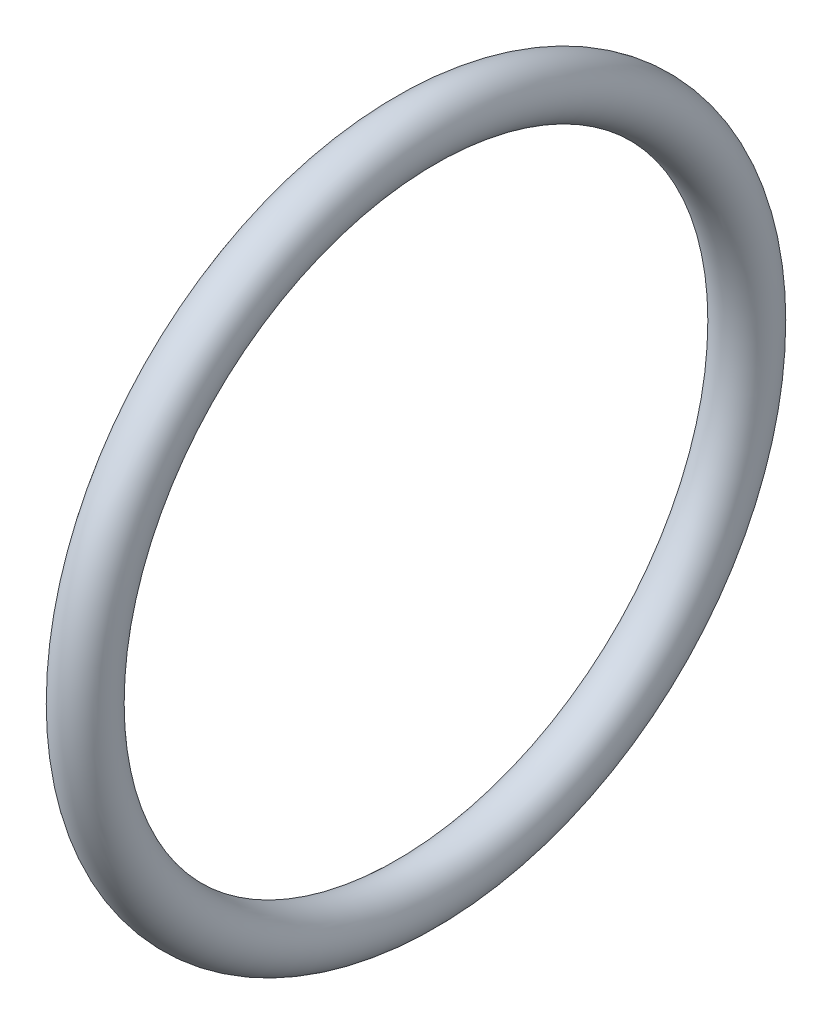
ISO-10303-21;
HEADER;
FILE_DESCRIPTION(('STEP AP214'),'2;1');
FILE_NAME('part.step','',(''),(''),'','','');
FILE_SCHEMA(('AUTOMOTIVE_DESIGN { 1 0 10303 214 1 1 1 1 }'));
ENDSEC;
DATA;
#1=APPLICATION_CONTEXT('core data for automotive mechanical design processes');
#2=APPLICATION_PROTOCOL_DEFINITION('international standard','automotive_design',2000,#1);
#3=PRODUCT_CONTEXT('',#1,'mechanical');
#4=PRODUCT('Part','Part','',(#3));
#5=PRODUCT_RELATED_PRODUCT_CATEGORY('part','',(#4));
#6=PRODUCT_DEFINITION_FORMATION('','',#4);
#7=PRODUCT_DEFINITION_CONTEXT('part definition',#1,'design');
#8=PRODUCT_DEFINITION('design','',#6,#7);
#9=PRODUCT_DEFINITION_SHAPE('','',#8);
#10=(LENGTH_UNIT() NAMED_UNIT(*) SI_UNIT(.MILLI.,.METRE.));
#11=(NAMED_UNIT(*) PLANE_ANGLE_UNIT() SI_UNIT($,.RADIAN.));
#12=(NAMED_UNIT(*) SI_UNIT($,.STERADIAN.) SOLID_ANGLE_UNIT());
#13=UNCERTAINTY_MEASURE_WITH_UNIT(LENGTH_MEASURE(1.E-05),#10,'distance_accuracy_value','');
#14=(GEOMETRIC_REPRESENTATION_CONTEXT(3) GLOBAL_UNCERTAINTY_ASSIGNED_CONTEXT((#13)) GLOBAL_UNIT_ASSIGNED_CONTEXT((#10,
#11,#12)) REPRESENTATION_CONTEXT('',''));
#15=CARTESIAN_POINT('',(0.,0.,0.));
#16=DIRECTION('',(0.,0.,1.));
#17=DIRECTION('',(1.,0.,0.));
#18=AXIS2_PLACEMENT_3D('',#15,#16,#17);
#19=CARTESIAN_POINT('',(0.,0.,0.));
#20=DIRECTION('',(-1.,0.,0.));
#21=DIRECTION('',(0.,0.,1.));
#22=AXIS2_PLACEMENT_3D('',#19,#20,#21);
#23=TOROIDAL_SURFACE('',#22,12.,1.);
#24=CARTESIAN_POINT('',(0.,0.,13.));
#25=VERTEX_POINT('',#24);
#26=VERTEX_LOOP('',#25);
#27=FACE_BOUND('',#26,.T.);
#28=ADVANCED_FACE('F33',(#27),#23,.T.);
#29=CLOSED_SHELL('',(#28));
#30=MANIFOLD_SOLID_BREP('B2',#29);
#31=ADVANCED_BREP_SHAPE_REPRESENTATION('',(#18,#30),#14);
#32=SHAPE_DEFINITION_REPRESENTATION(#9,#31);
ENDSEC;
END-ISO-10303-21;
